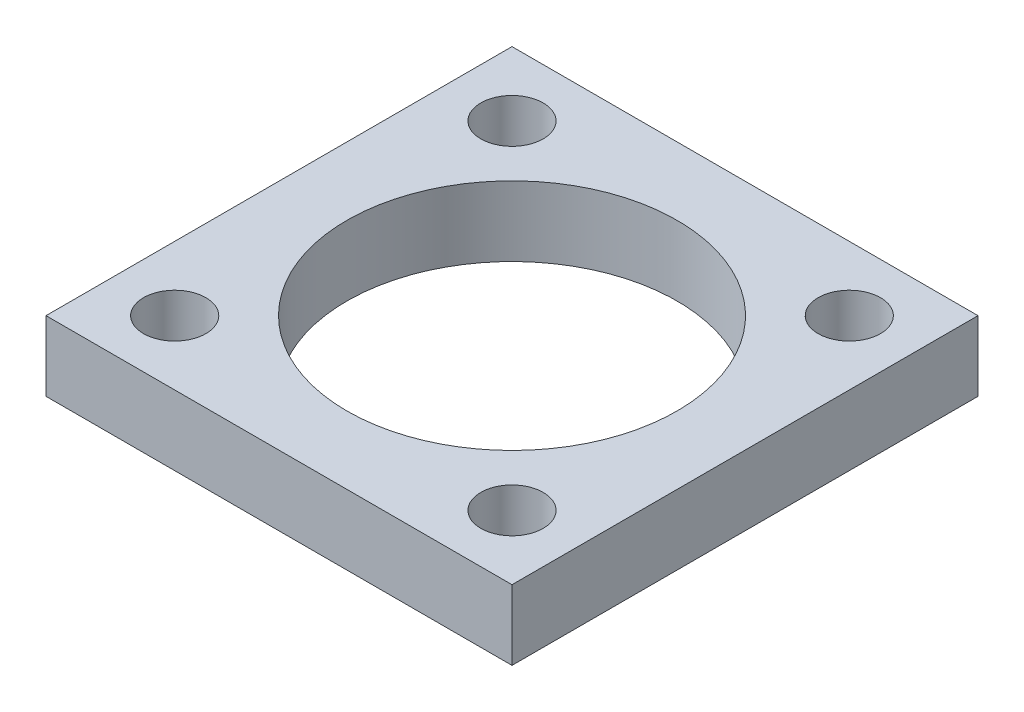
ISO-10303-21;
HEADER;
FILE_DESCRIPTION(('STEP AP214'),'2;1');
FILE_NAME('part.step','',(''),(''),'','','');
FILE_SCHEMA(('AUTOMOTIVE_DESIGN { 1 0 10303 214 1 1 1 1 }'));
ENDSEC;
DATA;
#1=APPLICATION_CONTEXT('core data for automotive mechanical design processes');
#2=APPLICATION_PROTOCOL_DEFINITION('international standard','automotive_design',2000,#1);
#3=PRODUCT_CONTEXT('',#1,'mechanical');
#4=PRODUCT('Part','Part','',(#3));
#5=PRODUCT_RELATED_PRODUCT_CATEGORY('part','',(#4));
#6=PRODUCT_DEFINITION_FORMATION('','',#4);
#7=PRODUCT_DEFINITION_CONTEXT('part definition',#1,'design');
#8=PRODUCT_DEFINITION('design','',#6,#7);
#9=PRODUCT_DEFINITION_SHAPE('','',#8);
#10=(LENGTH_UNIT() NAMED_UNIT(*) SI_UNIT(.MILLI.,.METRE.));
#11=(NAMED_UNIT(*) PLANE_ANGLE_UNIT() SI_UNIT($,.RADIAN.));
#12=(NAMED_UNIT(*) SI_UNIT($,.STERADIAN.) SOLID_ANGLE_UNIT());
#13=UNCERTAINTY_MEASURE_WITH_UNIT(LENGTH_MEASURE(1.E-05),#10,'distance_accuracy_value','');
#14=(GEOMETRIC_REPRESENTATION_CONTEXT(3) GLOBAL_UNCERTAINTY_ASSIGNED_CONTEXT((#13)) GLOBAL_UNIT_ASSIGNED_CONTEXT((#10,
#11,#12)) REPRESENTATION_CONTEXT('',''));
#15=CARTESIAN_POINT('',(0.,0.,0.));
#16=DIRECTION('',(0.,0.,1.));
#17=DIRECTION('',(1.,0.,0.));
#18=AXIS2_PLACEMENT_3D('',#15,#16,#17);
#19=CARTESIAN_POINT('',(12.7,3.81,12.7));
#20=DIRECTION('',(-1.,0.,0.));
#21=DIRECTION('',(0.,0.,1.));
#22=AXIS2_PLACEMENT_3D('',#19,#20,#21);
#23=PLANE('',#22);
#24=DIRECTION('',(0.,0.,-1.));
#25=VECTOR('',#24,1.);
#26=CARTESIAN_POINT('',(12.7,0.,12.7));
#27=LINE('',#26,#25);
#28=CARTESIAN_POINT('',(12.7,0.,12.7));
#29=VERTEX_POINT('',#28);
#30=CARTESIAN_POINT('',(12.7,0.,-12.7));
#31=VERTEX_POINT('',#30);
#32=EDGE_CURVE('E97',#29,#31,#27,.T.);
#33=ORIENTED_EDGE('',*,*,#32,.T.);
#34=DIRECTION('',(0.,-1.,0.));
#35=VECTOR('',#34,1.);
#36=CARTESIAN_POINT('',(12.7,3.81,-12.7));
#37=LINE('',#36,#35);
#38=CARTESIAN_POINT('',(12.7,3.81,-12.7));
#39=VERTEX_POINT('',#38);
#40=EDGE_CURVE('E11',#39,#31,#37,.T.);
#41=ORIENTED_EDGE('',*,*,#40,.F.);
#42=DIRECTION('',(0.,0.,-1.));
#43=VECTOR('',#42,1.);
#44=CARTESIAN_POINT('',(12.7,3.81,12.7));
#45=LINE('',#44,#43);
#46=CARTESIAN_POINT('',(12.7,3.81,12.7));
#47=VERTEX_POINT('',#46);
#48=EDGE_CURVE('E85',#47,#39,#45,.T.);
#49=ORIENTED_EDGE('',*,*,#48,.F.);
#50=DIRECTION('',(0.,-1.,0.));
#51=VECTOR('',#50,1.);
#52=CARTESIAN_POINT('',(12.7,3.81,12.7));
#53=LINE('',#52,#51);
#54=EDGE_CURVE('E93',#47,#29,#53,.T.);
#55=ORIENTED_EDGE('',*,*,#54,.T.);
#56=EDGE_LOOP('',(#33,#41,#49,#55));
#57=FACE_BOUND('',#56,.T.);
#58=ADVANCED_FACE('F34',(#57),#23,.F.);
#59=CARTESIAN_POINT('',(-12.7,3.81,-12.7));
#60=DIRECTION('',(0.,0.,1.));
#61=DIRECTION('',(1.,0.,0.));
#62=AXIS2_PLACEMENT_3D('',#59,#60,#61);
#63=PLANE('',#62);
#64=DIRECTION('',(-1.,0.,0.));
#65=VECTOR('',#64,1.);
#66=CARTESIAN_POINT('',(-12.7,0.,-12.7));
#67=LINE('',#66,#65);
#68=CARTESIAN_POINT('',(-12.7,0.,-12.7));
#69=VERTEX_POINT('',#68);
#70=EDGE_CURVE('E89',#31,#69,#67,.T.);
#71=ORIENTED_EDGE('',*,*,#70,.T.);
#72=DIRECTION('',(0.,-1.,0.));
#73=VECTOR('',#72,1.);
#74=CARTESIAN_POINT('',(-12.7,3.81,-12.7));
#75=LINE('',#74,#73);
#76=CARTESIAN_POINT('',(-12.7,3.81,-12.7));
#77=VERTEX_POINT('',#76);
#78=EDGE_CURVE('E42',#77,#69,#75,.T.);
#79=ORIENTED_EDGE('',*,*,#78,.F.);
#80=DIRECTION('',(-1.,0.,0.));
#81=VECTOR('',#80,1.);
#82=CARTESIAN_POINT('',(-12.7,3.81,-12.7));
#83=LINE('',#82,#81);
#84=EDGE_CURVE('E80',#39,#77,#83,.T.);
#85=ORIENTED_EDGE('',*,*,#84,.F.);
#86=ORIENTED_EDGE('',*,*,#40,.T.);
#87=EDGE_LOOP('',(#71,#79,#85,#86));
#88=FACE_BOUND('',#87,.T.);
#89=ADVANCED_FACE('F88',(#88),#63,.F.);
#90=CARTESIAN_POINT('',(-12.7,3.81,12.7));
#91=DIRECTION('',(1.,0.,0.));
#92=DIRECTION('',(0.,0.,-1.));
#93=AXIS2_PLACEMENT_3D('',#90,#91,#92);
#94=PLANE('',#93);
#95=DIRECTION('',(0.,0.,1.));
#96=VECTOR('',#95,1.);
#97=CARTESIAN_POINT('',(-12.7,0.,12.7));
#98=LINE('',#97,#96);
#99=CARTESIAN_POINT('',(-12.7,0.,12.7));
#100=VERTEX_POINT('',#99);
#101=EDGE_CURVE('E67',#69,#100,#98,.T.);
#102=ORIENTED_EDGE('',*,*,#101,.T.);
#103=DIRECTION('',(0.,-1.,0.));
#104=VECTOR('',#103,1.);
#105=CARTESIAN_POINT('',(-12.7,3.81,12.7));
#106=LINE('',#105,#104);
#107=CARTESIAN_POINT('',(-12.7,3.81,12.7));
#108=VERTEX_POINT('',#107);
#109=EDGE_CURVE('E90',#108,#100,#106,.T.);
#110=ORIENTED_EDGE('',*,*,#109,.F.);
#111=DIRECTION('',(0.,0.,1.));
#112=VECTOR('',#111,1.);
#113=CARTESIAN_POINT('',(-12.7,3.81,12.7));
#114=LINE('',#113,#112);
#115=EDGE_CURVE('E83',#77,#108,#114,.T.);
#116=ORIENTED_EDGE('',*,*,#115,.F.);
#117=ORIENTED_EDGE('',*,*,#78,.T.);
#118=EDGE_LOOP('',(#102,#110,#116,#117));
#119=FACE_BOUND('',#118,.T.);
#120=ADVANCED_FACE('F91',(#119),#94,.F.);
#121=CARTESIAN_POINT('',(-12.7,3.81,12.7));
#122=DIRECTION('',(0.,0.,-1.));
#123=DIRECTION('',(-1.,0.,0.));
#124=AXIS2_PLACEMENT_3D('',#121,#122,#123);
#125=PLANE('',#124);
#126=DIRECTION('',(1.,0.,0.));
#127=VECTOR('',#126,1.);
#128=CARTESIAN_POINT('',(-12.7,0.,12.7));
#129=LINE('',#128,#127);
#130=EDGE_CURVE('E73',#100,#29,#129,.T.);
#131=ORIENTED_EDGE('',*,*,#130,.T.);
#132=ORIENTED_EDGE('',*,*,#54,.F.);
#133=DIRECTION('',(1.,0.,0.));
#134=VECTOR('',#133,1.);
#135=CARTESIAN_POINT('',(-12.7,3.81,12.7));
#136=LINE('',#135,#134);
#137=EDGE_CURVE('E50',#108,#47,#136,.T.);
#138=ORIENTED_EDGE('',*,*,#137,.F.);
#139=ORIENTED_EDGE('',*,*,#109,.T.);
#140=EDGE_LOOP('',(#131,#132,#138,#139));
#141=FACE_BOUND('',#140,.T.);
#142=ADVANCED_FACE('F105',(#141),#125,.F.);
#143=CARTESIAN_POINT('',(0.,3.81,0.));
#144=DIRECTION('',(0.,-1.,0.));
#145=DIRECTION('',(0.,0.,-1.));
#146=AXIS2_PLACEMENT_3D('',#143,#144,#145);
#147=PLANE('',#146);
#148=CARTESIAN_POINT('',(-9.1923881554251,3.81,-9.19238815542513));
#149=DIRECTION('',(0.,1.,0.));
#150=DIRECTION('',(0.,0.,1.));
#151=AXIS2_PLACEMENT_3D('',#148,#149,#150);
#152=CIRCLE('',#151,1.7);
#153=CARTESIAN_POINT('',(-9.1923881554251,3.81,-7.49238815542513));
#154=VERTEX_POINT('',#153);
#155=EDGE_CURVE('E137',#154,#154,#152,.T.);
#156=ORIENTED_EDGE('',*,*,#155,.F.);
#157=EDGE_LOOP('',(#156));
#158=FACE_BOUND('',#157,.T.);
#159=CARTESIAN_POINT('',(9.1923881554251,3.81,9.19238815542512));
#160=DIRECTION('',(0.,1.,0.));
#161=DIRECTION('',(0.,0.,1.));
#162=AXIS2_PLACEMENT_3D('',#159,#160,#161);
#163=CIRCLE('',#162,1.7);
#164=CARTESIAN_POINT('',(9.1923881554251,3.81,10.8923881554251));
#165=VERTEX_POINT('',#164);
#166=EDGE_CURVE('E131',#165,#165,#163,.T.);
#167=ORIENTED_EDGE('',*,*,#166,.F.);
#168=EDGE_LOOP('',(#167));
#169=FACE_BOUND('',#168,.T.);
#170=CARTESIAN_POINT('',(9.19238815542516,3.81,-9.19238815542507));
#171=DIRECTION('',(0.,1.,0.));
#172=DIRECTION('',(0.,0.,1.));
#173=AXIS2_PLACEMENT_3D('',#170,#171,#172);
#174=CIRCLE('',#173,1.7);
#175=CARTESIAN_POINT('',(9.19238815542516,3.81,-7.49238815542507));
#176=VERTEX_POINT('',#175);
#177=EDGE_CURVE('E125',#176,#176,#174,.T.);
#178=ORIENTED_EDGE('',*,*,#177,.F.);
#179=EDGE_LOOP('',(#178));
#180=FACE_BOUND('',#179,.T.);
#181=CARTESIAN_POINT('',(-9.19238815542516,3.81,9.19238815542507));
#182=DIRECTION('',(0.,1.,0.));
#183=DIRECTION('',(0.,0.,1.));
#184=AXIS2_PLACEMENT_3D('',#181,#182,#183);
#185=CIRCLE('',#184,1.7);
#186=CARTESIAN_POINT('',(-9.19238815542516,3.81,10.8923881554251));
#187=VERTEX_POINT('',#186);
#188=EDGE_CURVE('E119',#187,#187,#185,.T.);
#189=ORIENTED_EDGE('',*,*,#188,.F.);
#190=EDGE_LOOP('',(#189));
#191=FACE_BOUND('',#190,.T.);
#192=CARTESIAN_POINT('',(0.,3.81,0.));
#193=DIRECTION('',(0.,1.,0.));
#194=DIRECTION('',(0.,0.,1.));
#195=AXIS2_PLACEMENT_3D('',#192,#193,#194);
#196=CIRCLE('',#195,9.);
#197=CARTESIAN_POINT('',(0.,3.81,9.));
#198=VERTEX_POINT('',#197);
#199=EDGE_CURVE('E111',#198,#198,#196,.T.);
#200=ORIENTED_EDGE('',*,*,#199,.F.);
#201=EDGE_LOOP('',(#200));
#202=FACE_BOUND('',#201,.T.);
#203=ORIENTED_EDGE('',*,*,#48,.T.);
#204=ORIENTED_EDGE('',*,*,#84,.T.);
#205=ORIENTED_EDGE('',*,*,#115,.T.);
#206=ORIENTED_EDGE('',*,*,#137,.T.);
#207=EDGE_LOOP('',(#203,#204,#205,#206));
#208=FACE_BOUND('',#207,.T.);
#209=ADVANCED_FACE('F81',(#158,#169,#180,#191,#202,#208),#147,.F.);
#210=CARTESIAN_POINT('',(0.,0.,0.));
#211=DIRECTION('',(0.,-1.,0.));
#212=DIRECTION('',(0.,0.,-1.));
#213=AXIS2_PLACEMENT_3D('',#210,#211,#212);
#214=PLANE('',#213);
#215=CARTESIAN_POINT('',(-9.1923881554251,0.,-9.19238815542513));
#216=DIRECTION('',(0.,1.,0.));
#217=DIRECTION('',(0.,0.,1.));
#218=AXIS2_PLACEMENT_3D('',#215,#216,#217);
#219=CIRCLE('',#218,1.7);
#220=CARTESIAN_POINT('',(-9.1923881554251,0.,-7.49238815542513));
#221=VERTEX_POINT('',#220);
#222=EDGE_CURVE('E134',#221,#221,#219,.T.);
#223=ORIENTED_EDGE('',*,*,#222,.T.);
#224=EDGE_LOOP('',(#223));
#225=FACE_BOUND('',#224,.T.);
#226=CARTESIAN_POINT('',(9.1923881554251,0.,9.19238815542512));
#227=DIRECTION('',(0.,1.,0.));
#228=DIRECTION('',(0.,0.,1.));
#229=AXIS2_PLACEMENT_3D('',#226,#227,#228);
#230=CIRCLE('',#229,1.7);
#231=CARTESIAN_POINT('',(9.1923881554251,0.,10.8923881554251));
#232=VERTEX_POINT('',#231);
#233=EDGE_CURVE('E128',#232,#232,#230,.T.);
#234=ORIENTED_EDGE('',*,*,#233,.T.);
#235=EDGE_LOOP('',(#234));
#236=FACE_BOUND('',#235,.T.);
#237=CARTESIAN_POINT('',(9.19238815542516,0.,-9.19238815542507));
#238=DIRECTION('',(0.,1.,0.));
#239=DIRECTION('',(0.,0.,1.));
#240=AXIS2_PLACEMENT_3D('',#237,#238,#239);
#241=CIRCLE('',#240,1.7);
#242=CARTESIAN_POINT('',(9.19238815542516,0.,-7.49238815542507));
#243=VERTEX_POINT('',#242);
#244=EDGE_CURVE('E122',#243,#243,#241,.T.);
#245=ORIENTED_EDGE('',*,*,#244,.T.);
#246=EDGE_LOOP('',(#245));
#247=FACE_BOUND('',#246,.T.);
#248=CARTESIAN_POINT('',(-9.19238815542516,0.,9.19238815542507));
#249=DIRECTION('',(0.,1.,0.));
#250=DIRECTION('',(0.,0.,1.));
#251=AXIS2_PLACEMENT_3D('',#248,#249,#250);
#252=CIRCLE('',#251,1.7);
#253=CARTESIAN_POINT('',(-9.19238815542516,0.,10.8923881554251));
#254=VERTEX_POINT('',#253);
#255=EDGE_CURVE('E114',#254,#254,#252,.T.);
#256=ORIENTED_EDGE('',*,*,#255,.T.);
#257=EDGE_LOOP('',(#256));
#258=FACE_BOUND('',#257,.T.);
#259=CARTESIAN_POINT('',(0.,0.,0.));
#260=DIRECTION('',(0.,1.,0.));
#261=DIRECTION('',(0.,0.,1.));
#262=AXIS2_PLACEMENT_3D('',#259,#260,#261);
#263=CIRCLE('',#262,9.);
#264=CARTESIAN_POINT('',(0.,0.,9.));
#265=VERTEX_POINT('',#264);
#266=EDGE_CURVE('E100',#265,#265,#263,.T.);
#267=ORIENTED_EDGE('',*,*,#266,.T.);
#268=EDGE_LOOP('',(#267));
#269=FACE_BOUND('',#268,.T.);
#270=ORIENTED_EDGE('',*,*,#32,.F.);
#271=ORIENTED_EDGE('',*,*,#130,.F.);
#272=ORIENTED_EDGE('',*,*,#101,.F.);
#273=ORIENTED_EDGE('',*,*,#70,.F.);
#274=EDGE_LOOP('',(#270,#271,#272,#273));
#275=FACE_BOUND('',#274,.T.);
#276=ADVANCED_FACE('F108',(#225,#236,#247,#258,#269,#275),#214,.T.);
#277=CARTESIAN_POINT('',(0.,0.,0.));
#278=DIRECTION('',(0.,1.,0.));
#279=DIRECTION('',(0.,0.,1.));
#280=AXIS2_PLACEMENT_3D('',#277,#278,#279);
#281=CYLINDRICAL_SURFACE('',#280,9.);
#282=ORIENTED_EDGE('',*,*,#266,.F.);
#283=EDGE_LOOP('',(#282));
#284=FACE_BOUND('',#283,.T.);
#285=ORIENTED_EDGE('',*,*,#199,.T.);
#286=EDGE_LOOP('',(#285));
#287=FACE_BOUND('',#286,.T.);
#288=ADVANCED_FACE('F154',(#284,#287),#281,.F.);
#289=CARTESIAN_POINT('',(-9.19238815542516,3.81,9.19238815542507));
#290=DIRECTION('',(0.,1.,0.));
#291=DIRECTION('',(0.,0.,1.));
#292=AXIS2_PLACEMENT_3D('',#289,#290,#291);
#293=CYLINDRICAL_SURFACE('',#292,1.7);
#294=ORIENTED_EDGE('',*,*,#255,.F.);
#295=EDGE_LOOP('',(#294));
#296=FACE_BOUND('',#295,.T.);
#297=ORIENTED_EDGE('',*,*,#188,.T.);
#298=EDGE_LOOP('',(#297));
#299=FACE_BOUND('',#298,.T.);
#300=ADVANCED_FACE('F156',(#296,#299),#293,.F.);
#301=CARTESIAN_POINT('',(9.19238815542516,3.81,-9.19238815542507));
#302=DIRECTION('',(0.,1.,0.));
#303=DIRECTION('',(0.,0.,1.));
#304=AXIS2_PLACEMENT_3D('',#301,#302,#303);
#305=CYLINDRICAL_SURFACE('',#304,1.7);
#306=ORIENTED_EDGE('',*,*,#244,.F.);
#307=EDGE_LOOP('',(#306));
#308=FACE_BOUND('',#307,.T.);
#309=ORIENTED_EDGE('',*,*,#177,.T.);
#310=EDGE_LOOP('',(#309));
#311=FACE_BOUND('',#310,.T.);
#312=ADVANCED_FACE('F163',(#308,#311),#305,.F.);
#313=CARTESIAN_POINT('',(9.1923881554251,3.81,9.19238815542512));
#314=DIRECTION('',(0.,1.,0.));
#315=DIRECTION('',(0.,0.,1.));
#316=AXIS2_PLACEMENT_3D('',#313,#314,#315);
#317=CYLINDRICAL_SURFACE('',#316,1.7);
#318=ORIENTED_EDGE('',*,*,#233,.F.);
#319=EDGE_LOOP('',(#318));
#320=FACE_BOUND('',#319,.T.);
#321=ORIENTED_EDGE('',*,*,#166,.T.);
#322=EDGE_LOOP('',(#321));
#323=FACE_BOUND('',#322,.T.);
#324=ADVANCED_FACE('F207',(#320,#323),#317,.F.);
#325=CARTESIAN_POINT('',(-9.1923881554251,3.81,-9.19238815542513));
#326=DIRECTION('',(0.,1.,0.));
#327=DIRECTION('',(0.,0.,1.));
#328=AXIS2_PLACEMENT_3D('',#325,#326,#327);
#329=CYLINDRICAL_SURFACE('',#328,1.7);
#330=ORIENTED_EDGE('',*,*,#222,.F.);
#331=EDGE_LOOP('',(#330));
#332=FACE_BOUND('',#331,.T.);
#333=ORIENTED_EDGE('',*,*,#155,.T.);
#334=EDGE_LOOP('',(#333));
#335=FACE_BOUND('',#334,.T.);
#336=ADVANCED_FACE('F141',(#332,#335),#329,.F.);
#337=CLOSED_SHELL('',(#58,#89,#120,#142,#209,#276,#288,#300,#312,#324,#336));
#338=MANIFOLD_SOLID_BREP('B2',#337);
#339=ADVANCED_BREP_SHAPE_REPRESENTATION('',(#18,#338),#14);
#340=SHAPE_DEFINITION_REPRESENTATION(#9,#339);
ENDSEC;
END-ISO-10303-21;
